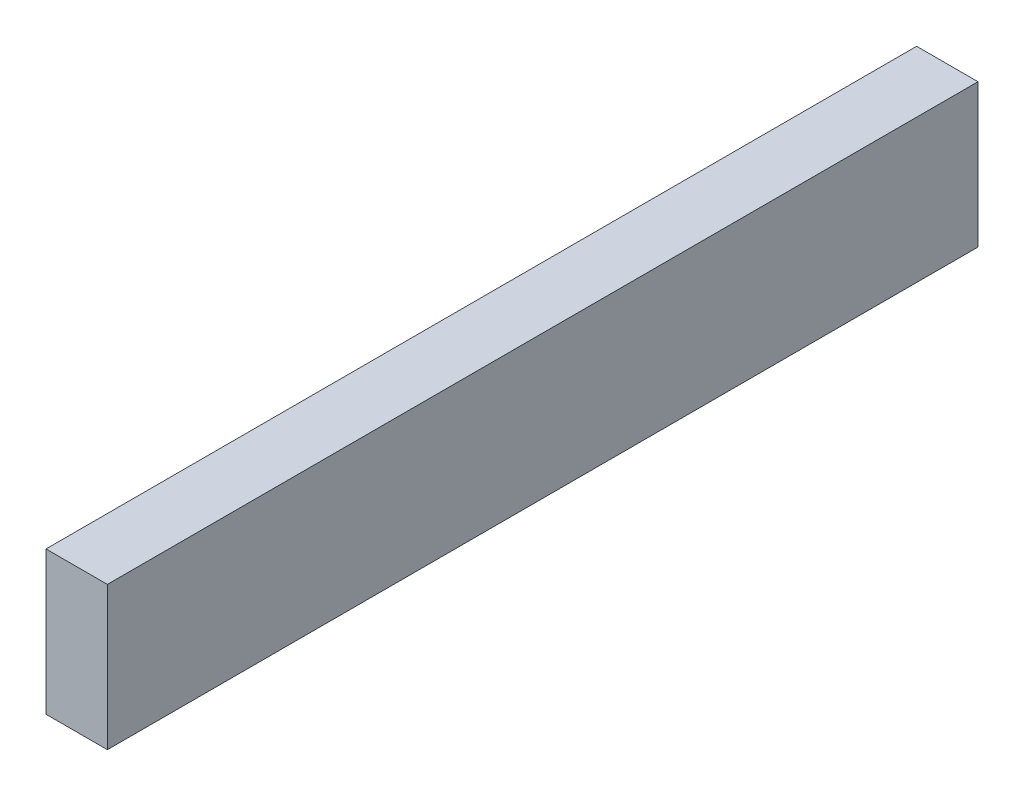
ISO-10303-21;
HEADER;
FILE_DESCRIPTION(('STEP AP214'),'2;1');
FILE_NAME('part.step','',(''),(''),'','','');
FILE_SCHEMA(('AUTOMOTIVE_DESIGN { 1 0 10303 214 1 1 1 1 }'));
ENDSEC;
DATA;
#1=APPLICATION_CONTEXT('core data for automotive mechanical design processes');
#2=APPLICATION_PROTOCOL_DEFINITION('international standard','automotive_design',2000,#1);
#3=PRODUCT_CONTEXT('',#1,'mechanical');
#4=PRODUCT('Part','Part','',(#3));
#5=PRODUCT_RELATED_PRODUCT_CATEGORY('part','',(#4));
#6=PRODUCT_DEFINITION_FORMATION('','',#4);
#7=PRODUCT_DEFINITION_CONTEXT('part definition',#1,'design');
#8=PRODUCT_DEFINITION('design','',#6,#7);
#9=PRODUCT_DEFINITION_SHAPE('','',#8);
#10=(LENGTH_UNIT() NAMED_UNIT(*) SI_UNIT(.MILLI.,.METRE.));
#11=(NAMED_UNIT(*) PLANE_ANGLE_UNIT() SI_UNIT($,.RADIAN.));
#12=(NAMED_UNIT(*) SI_UNIT($,.STERADIAN.) SOLID_ANGLE_UNIT());
#13=UNCERTAINTY_MEASURE_WITH_UNIT(LENGTH_MEASURE(1.E-05),#10,'distance_accuracy_value','');
#14=(GEOMETRIC_REPRESENTATION_CONTEXT(3) GLOBAL_UNCERTAINTY_ASSIGNED_CONTEXT((#13)) GLOBAL_UNIT_ASSIGNED_CONTEXT((#10,
#11,#12)) REPRESENTATION_CONTEXT('',''));
#15=CARTESIAN_POINT('',(0.,0.,0.));
#16=DIRECTION('',(0.,0.,1.));
#17=DIRECTION('',(1.,0.,0.));
#18=AXIS2_PLACEMENT_3D('',#15,#16,#17);
#19=CARTESIAN_POINT('',(-2.38001427093207,27.7705350483145,540.54375));
#20=DIRECTION('',(1.,0.,0.));
#21=DIRECTION('',(0.,1.,0.));
#22=AXIS2_PLACEMENT_3D('',#19,#20,#21);
#23=PLANE('',#22);
#24=DIRECTION('',(0.,-1.,0.));
#25=VECTOR('',#24,1.);
#26=CARTESIAN_POINT('',(-2.38001427093207,27.7705350483145,0.));
#27=LINE('',#26,#25);
#28=CARTESIAN_POINT('',(-2.38001427093207,27.7705350483145,0.));
#29=VERTEX_POINT('',#28);
#30=CARTESIAN_POINT('',(-2.38001427093206,-61.1294649516855,0.));
#31=VERTEX_POINT('',#30);
#32=EDGE_CURVE('E95',#29,#31,#27,.T.);
#33=ORIENTED_EDGE('',*,*,#32,.T.);
#34=DIRECTION('',(0.,0.,-1.));
#35=VECTOR('',#34,1.);
#36=CARTESIAN_POINT('',(-2.38001427093206,-61.1294649516855,540.54375));
#37=LINE('',#36,#35);
#38=CARTESIAN_POINT('',(-2.38001427093206,-61.1294649516855,540.54375));
#39=VERTEX_POINT('',#38);
#40=EDGE_CURVE('E11',#39,#31,#37,.T.);
#41=ORIENTED_EDGE('',*,*,#40,.F.);
#42=DIRECTION('',(0.,-1.,0.));
#43=VECTOR('',#42,1.);
#44=CARTESIAN_POINT('',(-2.38001427093207,27.7705350483145,540.54375));
#45=LINE('',#44,#43);
#46=CARTESIAN_POINT('',(-2.38001427093207,27.7705350483145,540.54375));
#47=VERTEX_POINT('',#46);
#48=EDGE_CURVE('E83',#47,#39,#45,.T.);
#49=ORIENTED_EDGE('',*,*,#48,.F.);
#50=DIRECTION('',(0.,0.,-1.));
#51=VECTOR('',#50,1.);
#52=CARTESIAN_POINT('',(-2.38001427093207,27.7705350483145,540.54375));
#53=LINE('',#52,#51);
#54=EDGE_CURVE('E91',#47,#29,#53,.T.);
#55=ORIENTED_EDGE('',*,*,#54,.T.);
#56=EDGE_LOOP('',(#33,#41,#49,#55));
#57=FACE_BOUND('',#56,.T.);
#58=ADVANCED_FACE('F32',(#57),#23,.F.);
#59=CARTESIAN_POINT('',(-2.38001427093206,-61.1294649516855,540.54375));
#60=DIRECTION('',(0.,1.,0.));
#61=DIRECTION('',(0.,0.,1.));
#62=AXIS2_PLACEMENT_3D('',#59,#60,#61);
#63=PLANE('',#62);
#64=DIRECTION('',(1.,0.,0.));
#65=VECTOR('',#64,1.);
#66=CARTESIAN_POINT('',(-2.38001427093206,-61.1294649516855,0.));
#67=LINE('',#66,#65);
#68=CARTESIAN_POINT('',(35.7199857290679,-61.1294649516855,0.));
#69=VERTEX_POINT('',#68);
#70=EDGE_CURVE('E87',#31,#69,#67,.T.);
#71=ORIENTED_EDGE('',*,*,#70,.T.);
#72=DIRECTION('',(0.,0.,-1.));
#73=VECTOR('',#72,1.);
#74=CARTESIAN_POINT('',(35.7199857290679,-61.1294649516855,540.54375));
#75=LINE('',#74,#73);
#76=CARTESIAN_POINT('',(35.7199857290679,-61.1294649516855,540.54375));
#77=VERTEX_POINT('',#76);
#78=EDGE_CURVE('E40',#77,#69,#75,.T.);
#79=ORIENTED_EDGE('',*,*,#78,.F.);
#80=DIRECTION('',(1.,0.,0.));
#81=VECTOR('',#80,1.);
#82=CARTESIAN_POINT('',(-2.38001427093206,-61.1294649516855,540.54375));
#83=LINE('',#82,#81);
#84=EDGE_CURVE('E78',#39,#77,#83,.T.);
#85=ORIENTED_EDGE('',*,*,#84,.F.);
#86=ORIENTED_EDGE('',*,*,#40,.T.);
#87=EDGE_LOOP('',(#71,#79,#85,#86));
#88=FACE_BOUND('',#87,.T.);
#89=ADVANCED_FACE('F86',(#88),#63,.F.);
#90=CARTESIAN_POINT('',(35.7199857290679,27.7705350483145,540.54375));
#91=DIRECTION('',(-1.,0.,0.));
#92=DIRECTION('',(0.,-1.,0.));
#93=AXIS2_PLACEMENT_3D('',#90,#91,#92);
#94=PLANE('',#93);
#95=DIRECTION('',(0.,1.,0.));
#96=VECTOR('',#95,1.);
#97=CARTESIAN_POINT('',(35.7199857290679,27.7705350483145,0.));
#98=LINE('',#97,#96);
#99=CARTESIAN_POINT('',(35.7199857290679,27.7705350483145,0.));
#100=VERTEX_POINT('',#99);
#101=EDGE_CURVE('E65',#69,#100,#98,.T.);
#102=ORIENTED_EDGE('',*,*,#101,.T.);
#103=DIRECTION('',(0.,0.,-1.));
#104=VECTOR('',#103,1.);
#105=CARTESIAN_POINT('',(35.7199857290679,27.7705350483145,540.54375));
#106=LINE('',#105,#104);
#107=CARTESIAN_POINT('',(35.7199857290679,27.7705350483145,540.54375));
#108=VERTEX_POINT('',#107);
#109=EDGE_CURVE('E88',#108,#100,#106,.T.);
#110=ORIENTED_EDGE('',*,*,#109,.F.);
#111=DIRECTION('',(0.,1.,0.));
#112=VECTOR('',#111,1.);
#113=CARTESIAN_POINT('',(35.7199857290679,27.7705350483145,540.54375));
#114=LINE('',#113,#112);
#115=EDGE_CURVE('E81',#77,#108,#114,.T.);
#116=ORIENTED_EDGE('',*,*,#115,.F.);
#117=ORIENTED_EDGE('',*,*,#78,.T.);
#118=EDGE_LOOP('',(#102,#110,#116,#117));
#119=FACE_BOUND('',#118,.T.);
#120=ADVANCED_FACE('F89',(#119),#94,.F.);
#121=CARTESIAN_POINT('',(-2.38001427093207,27.7705350483145,540.54375));
#122=DIRECTION('',(0.,-1.,0.));
#123=DIRECTION('',(0.,0.,-1.));
#124=AXIS2_PLACEMENT_3D('',#121,#122,#123);
#125=PLANE('',#124);
#126=DIRECTION('',(-1.,0.,0.));
#127=VECTOR('',#126,1.);
#128=CARTESIAN_POINT('',(-2.38001427093207,27.7705350483145,0.));
#129=LINE('',#128,#127);
#130=EDGE_CURVE('E71',#100,#29,#129,.T.);
#131=ORIENTED_EDGE('',*,*,#130,.T.);
#132=ORIENTED_EDGE('',*,*,#54,.F.);
#133=DIRECTION('',(-1.,0.,0.));
#134=VECTOR('',#133,1.);
#135=CARTESIAN_POINT('',(-2.38001427093207,27.7705350483145,540.54375));
#136=LINE('',#135,#134);
#137=EDGE_CURVE('E48',#108,#47,#136,.T.);
#138=ORIENTED_EDGE('',*,*,#137,.F.);
#139=ORIENTED_EDGE('',*,*,#109,.T.);
#140=EDGE_LOOP('',(#131,#132,#138,#139));
#141=FACE_BOUND('',#140,.T.);
#142=ADVANCED_FACE('F102',(#141),#125,.F.);
#143=CARTESIAN_POINT('',(0.,0.,540.54375));
#144=DIRECTION('',(0.,0.,1.));
#145=DIRECTION('',(1.,0.,0.));
#146=AXIS2_PLACEMENT_3D('',#143,#144,#145);
#147=PLANE('',#146);
#148=ORIENTED_EDGE('',*,*,#48,.T.);
#149=ORIENTED_EDGE('',*,*,#84,.T.);
#150=ORIENTED_EDGE('',*,*,#115,.T.);
#151=ORIENTED_EDGE('',*,*,#137,.T.);
#152=EDGE_LOOP('',(#148,#149,#150,#151));
#153=FACE_BOUND('',#152,.T.);
#154=ADVANCED_FACE('F79',(#153),#147,.T.);
#155=CARTESIAN_POINT('',(0.,0.,0.));
#156=DIRECTION('',(0.,0.,1.));
#157=DIRECTION('',(1.,0.,0.));
#158=AXIS2_PLACEMENT_3D('',#155,#156,#157);
#159=PLANE('',#158);
#160=ORIENTED_EDGE('',*,*,#32,.F.);
#161=ORIENTED_EDGE('',*,*,#130,.F.);
#162=ORIENTED_EDGE('',*,*,#101,.F.);
#163=ORIENTED_EDGE('',*,*,#70,.F.);
#164=EDGE_LOOP('',(#160,#161,#162,#163));
#165=FACE_BOUND('',#164,.T.);
#166=ADVANCED_FACE('F105',(#165),#159,.F.);
#167=CLOSED_SHELL('',(#58,#89,#120,#142,#154,#166));
#168=MANIFOLD_SOLID_BREP('B2',#167);
#169=ADVANCED_BREP_SHAPE_REPRESENTATION('',(#18,#168),#14);
#170=SHAPE_DEFINITION_REPRESENTATION(#9,#169);
ENDSEC;
END-ISO-10303-21;
